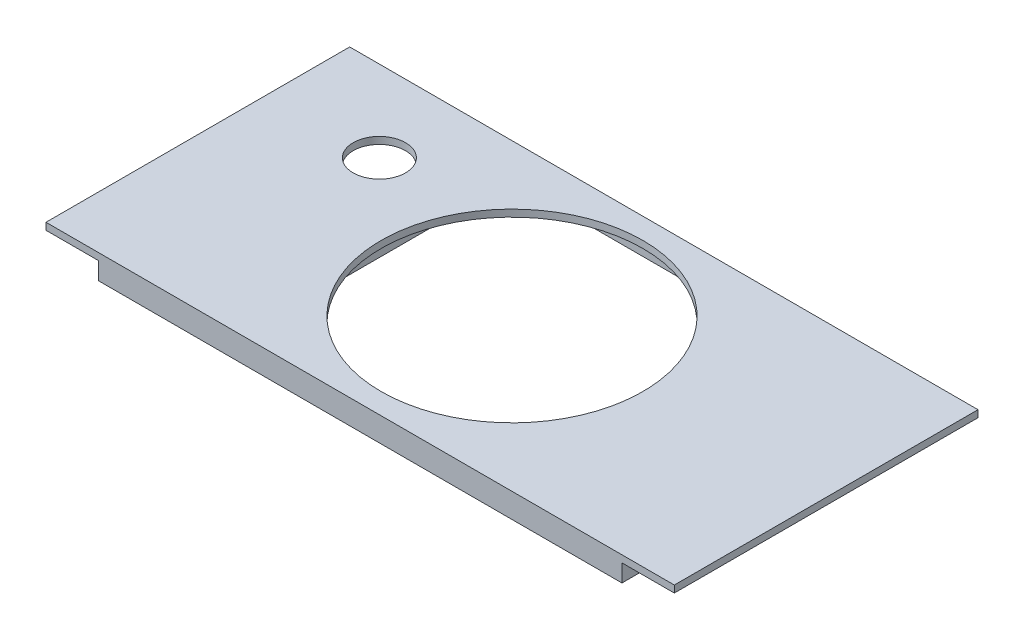
ISO-10303-21;
HEADER;
FILE_DESCRIPTION(('STEP AP214'),'2;1');
FILE_NAME('part.step','',(''),(''),'','','');
FILE_SCHEMA(('AUTOMOTIVE_DESIGN { 1 0 10303 214 1 1 1 1 }'));
ENDSEC;
DATA;
#1=APPLICATION_CONTEXT('core data for automotive mechanical design processes');
#2=APPLICATION_PROTOCOL_DEFINITION('international standard','automotive_design',2000,#1);
#3=PRODUCT_CONTEXT('',#1,'mechanical');
#4=PRODUCT('Part','Part','',(#3));
#5=PRODUCT_RELATED_PRODUCT_CATEGORY('part','',(#4));
#6=PRODUCT_DEFINITION_FORMATION('','',#4);
#7=PRODUCT_DEFINITION_CONTEXT('part definition',#1,'design');
#8=PRODUCT_DEFINITION('design','',#6,#7);
#9=PRODUCT_DEFINITION_SHAPE('','',#8);
#10=(LENGTH_UNIT() NAMED_UNIT(*) SI_UNIT(.MILLI.,.METRE.));
#11=(NAMED_UNIT(*) PLANE_ANGLE_UNIT() SI_UNIT($,.RADIAN.));
#12=(NAMED_UNIT(*) SI_UNIT($,.STERADIAN.) SOLID_ANGLE_UNIT());
#13=UNCERTAINTY_MEASURE_WITH_UNIT(LENGTH_MEASURE(1.E-05),#10,'distance_accuracy_value','');
#14=(GEOMETRIC_REPRESENTATION_CONTEXT(3) GLOBAL_UNCERTAINTY_ASSIGNED_CONTEXT((#13)) GLOBAL_UNIT_ASSIGNED_CONTEXT((#10,
#11,#12)) REPRESENTATION_CONTEXT('',''));
#15=CARTESIAN_POINT('',(0.,0.,0.));
#16=DIRECTION('',(0.,0.,1.));
#17=DIRECTION('',(1.,0.,0.));
#18=AXIS2_PLACEMENT_3D('',#15,#16,#17);
#19=CARTESIAN_POINT('',(0.,0.,0.));
#20=DIRECTION('',(0.,1.,0.));
#21=DIRECTION('',(0.,0.,1.));
#22=AXIS2_PLACEMENT_3D('',#19,#20,#21);
#23=PLANE('',#22);
#24=DIRECTION('',(1.,0.,0.));
#25=VECTOR('',#24,1.);
#26=CARTESIAN_POINT('',(-58.4029887206185,0.,40.7019366024999));
#27=LINE('',#26,#25);
#28=CARTESIAN_POINT('',(106.597011279381,0.,40.7019366024999));
#29=VERTEX_POINT('',#28);
#30=CARTESIAN_POINT('',(121.597011279381,0.,40.7019366024999));
#31=VERTEX_POINT('',#30);
#32=EDGE_CURVE('E286',#29,#31,#27,.T.);
#33=ORIENTED_EDGE('',*,*,#32,.F.);
#34=DIRECTION('',(0.,0.,-1.));
#35=VECTOR('',#34,1.);
#36=CARTESIAN_POINT('',(106.597011279381,0.,-46.2980633975001));
#37=LINE('',#36,#35);
#38=CARTESIAN_POINT('',(106.597011279381,0.,-46.2980633975001));
#39=VERTEX_POINT('',#38);
#40=EDGE_CURVE('E320',#29,#39,#37,.T.);
#41=ORIENTED_EDGE('',*,*,#40,.T.);
#42=DIRECTION('',(-1.,0.,0.));
#43=VECTOR('',#42,1.);
#44=CARTESIAN_POINT('',(-58.4029887206185,0.,-46.2980633975001));
#45=LINE('',#44,#43);
#46=CARTESIAN_POINT('',(121.597011279381,0.,-46.2980633975001));
#47=VERTEX_POINT('',#46);
#48=EDGE_CURVE('E277',#47,#39,#45,.T.);
#49=ORIENTED_EDGE('',*,*,#48,.F.);
#50=DIRECTION('',(0.,0.,-1.));
#51=VECTOR('',#50,1.);
#52=CARTESIAN_POINT('',(121.597011279381,0.,-46.2980633975001));
#53=LINE('',#52,#51);
#54=EDGE_CURVE('E289',#31,#47,#53,.T.);
#55=ORIENTED_EDGE('',*,*,#54,.F.);
#56=EDGE_LOOP('',(#33,#41,#49,#55));
#57=FACE_BOUND('',#56,.T.);
#58=ADVANCED_FACE('F33',(#57),#23,.F.);
#59=DIRECTION('',(0.,0.,-1.));
#60=VECTOR('',#59,1.);
#61=CARTESIAN_POINT('',(104.597011279381,0.,37.7019366024999));
#62=LINE('',#61,#60);
#63=CARTESIAN_POINT('',(104.597011279381,0.,37.7019366024999));
#64=VERTEX_POINT('',#63);
#65=CARTESIAN_POINT('',(104.597011279381,0.,-43.2980633975001));
#66=VERTEX_POINT('',#65);
#67=EDGE_CURVE('E184',#64,#66,#62,.T.);
#68=ORIENTED_EDGE('',*,*,#67,.F.);
#69=DIRECTION('',(1.,0.,0.));
#70=VECTOR('',#69,1.);
#71=CARTESIAN_POINT('',(106.597011279381,0.,37.7019366024999));
#72=LINE('',#71,#70);
#73=CARTESIAN_POINT('',(75.0970112793815,0.,37.7019366024999));
#74=VERTEX_POINT('',#73);
#75=EDGE_CURVE('E192',#74,#64,#72,.T.);
#76=ORIENTED_EDGE('',*,*,#75,.F.);
#77=DIRECTION('',(0.,0.,1.));
#78=VECTOR('',#77,1.);
#79=CARTESIAN_POINT('',(75.0970112793815,0.,-46.2980633975001));
#80=LINE('',#79,#78);
#81=CARTESIAN_POINT('',(75.0970112793815,0.,-43.2980633975001));
#82=VERTEX_POINT('',#81);
#83=EDGE_CURVE('E254',#82,#74,#80,.T.);
#84=ORIENTED_EDGE('',*,*,#83,.F.);
#85=DIRECTION('',(-1.,0.,0.));
#86=VECTOR('',#85,1.);
#87=CARTESIAN_POINT('',(106.597011279381,0.,-43.2980633975001));
#88=LINE('',#87,#86);
#89=EDGE_CURVE('E217',#66,#82,#88,.T.);
#90=ORIENTED_EDGE('',*,*,#89,.F.);
#91=EDGE_LOOP('',(#68,#76,#84,#90));
#92=FACE_BOUND('',#91,.T.);
#93=ADVANCED_FACE('F416',(#92),#23,.F.);
#94=CARTESIAN_POINT('',(106.597011279381,-5.,-43.2980633975001));
#95=DIRECTION('',(0.,0.,-1.));
#96=DIRECTION('',(-1.,0.,0.));
#97=AXIS2_PLACEMENT_3D('',#94,#95,#96);
#98=PLANE('',#97);
#99=DIRECTION('',(0.,1.,0.));
#100=VECTOR('',#99,1.);
#101=CARTESIAN_POINT('',(104.597011279381,-5.,-43.2980633975001));
#102=LINE('',#101,#100);
#103=CARTESIAN_POINT('',(104.597011279381,-5.,-43.2980633975001));
#104=VERTEX_POINT('',#103);
#105=EDGE_CURVE('E180',#104,#66,#102,.T.);
#106=ORIENTED_EDGE('',*,*,#105,.T.);
#107=ORIENTED_EDGE('',*,*,#89,.T.);
#108=DIRECTION('',(0.,-1.,0.));
#109=VECTOR('',#108,1.);
#110=CARTESIAN_POINT('',(75.0970112793815,-5.,-43.2980633975001));
#111=LINE('',#110,#109);
#112=CARTESIAN_POINT('',(75.0970112793815,-5.,-43.2980633975001));
#113=VERTEX_POINT('',#112);
#114=EDGE_CURVE('E221',#82,#113,#111,.T.);
#115=ORIENTED_EDGE('',*,*,#114,.T.);
#116=DIRECTION('',(-1.,0.,0.));
#117=VECTOR('',#116,1.);
#118=CARTESIAN_POINT('',(106.597011279381,-5.,-43.2980633975001));
#119=LINE('',#118,#117);
#120=EDGE_CURVE('E213',#104,#113,#119,.T.);
#121=ORIENTED_EDGE('',*,*,#120,.F.);
#122=EDGE_LOOP('',(#106,#107,#115,#121));
#123=FACE_BOUND('',#122,.T.);
#124=ADVANCED_FACE('F422',(#123),#98,.F.);
#125=CARTESIAN_POINT('',(106.597011279381,-5.,37.7019366024999));
#126=DIRECTION('',(0.,0.,1.));
#127=DIRECTION('',(1.,0.,0.));
#128=AXIS2_PLACEMENT_3D('',#125,#126,#127);
#129=PLANE('',#128);
#130=DIRECTION('',(0.,1.,0.));
#131=VECTOR('',#130,1.);
#132=CARTESIAN_POINT('',(104.597011279381,-5.,37.7019366024999));
#133=LINE('',#132,#131);
#134=CARTESIAN_POINT('',(104.597011279381,-5.,37.7019366024999));
#135=VERTEX_POINT('',#134);
#136=EDGE_CURVE('E177',#135,#64,#133,.T.);
#137=ORIENTED_EDGE('',*,*,#136,.F.);
#138=DIRECTION('',(1.,0.,0.));
#139=VECTOR('',#138,1.);
#140=CARTESIAN_POINT('',(106.597011279381,-5.,37.7019366024999));
#141=LINE('',#140,#139);
#142=CARTESIAN_POINT('',(75.0970112793815,-5.,37.7019366024999));
#143=VERTEX_POINT('',#142);
#144=EDGE_CURVE('E189',#143,#135,#141,.T.);
#145=ORIENTED_EDGE('',*,*,#144,.F.);
#146=DIRECTION('',(0.,1.,0.));
#147=VECTOR('',#146,1.);
#148=CARTESIAN_POINT('',(75.0970112793815,-5.,37.7019366024999));
#149=LINE('',#148,#147);
#150=EDGE_CURVE('E210',#143,#74,#149,.T.);
#151=ORIENTED_EDGE('',*,*,#150,.T.);
#152=ORIENTED_EDGE('',*,*,#75,.T.);
#153=EDGE_LOOP('',(#137,#145,#151,#152));
#154=FACE_BOUND('',#153,.T.);
#155=ADVANCED_FACE('F188',(#154),#129,.F.);
#156=DIRECTION('',(0.,0.,1.));
#157=VECTOR('',#156,1.);
#158=CARTESIAN_POINT('',(-43.4029887206185,0.,40.7019366024999));
#159=LINE('',#158,#157);
#160=CARTESIAN_POINT('',(-43.4029887206185,0.,-46.2980633975001));
#161=VERTEX_POINT('',#160);
#162=CARTESIAN_POINT('',(-43.4029887206185,0.,40.7019366024999));
#163=VERTEX_POINT('',#162);
#164=EDGE_CURVE('E342',#161,#163,#159,.T.);
#165=ORIENTED_EDGE('',*,*,#164,.T.);
#166=CARTESIAN_POINT('',(-58.4029887206185,0.,40.7019366024999));
#167=VERTEX_POINT('',#166);
#168=EDGE_CURVE('E294',#167,#163,#27,.T.);
#169=ORIENTED_EDGE('',*,*,#168,.F.);
#170=DIRECTION('',(0.,0.,1.));
#171=VECTOR('',#170,1.);
#172=CARTESIAN_POINT('',(-58.4029887206185,0.,-46.2980633975001));
#173=LINE('',#172,#171);
#174=CARTESIAN_POINT('',(-58.4029887206185,0.,-46.2980633975001));
#175=VERTEX_POINT('',#174);
#176=EDGE_CURVE('E272',#175,#167,#173,.T.);
#177=ORIENTED_EDGE('',*,*,#176,.F.);
#178=EDGE_CURVE('E297',#161,#175,#45,.T.);
#179=ORIENTED_EDGE('',*,*,#178,.F.);
#180=EDGE_LOOP('',(#165,#169,#177,#179));
#181=FACE_BOUND('',#180,.T.);
#182=ADVANCED_FACE('F340',(#181),#23,.F.);
#183=CARTESIAN_POINT('',(-26.6529887206185,0.,-23.0480633975001));
#184=DIRECTION('',(0.,-1.,0.));
#185=DIRECTION('',(0.,0.,-1.));
#186=AXIS2_PLACEMENT_3D('',#183,#184,#185);
#187=CIRCLE('',#186,7.5);
#188=CARTESIAN_POINT('',(-26.6529887206185,0.,-30.5480633975001));
#189=VERTEX_POINT('',#188);
#190=EDGE_CURVE('E374',#189,#189,#187,.T.);
#191=ORIENTED_EDGE('',*,*,#190,.F.);
#192=EDGE_LOOP('',(#191));
#193=FACE_BOUND('',#192,.T.);
#194=DIRECTION('',(0.,0.,1.));
#195=VECTOR('',#194,1.);
#196=CARTESIAN_POINT('',(-41.4029887206185,0.,-43.2980633975001));
#197=LINE('',#196,#195);
#198=CARTESIAN_POINT('',(-41.4029887206185,0.,-43.2980633975001));
#199=VERTEX_POINT('',#198);
#200=CARTESIAN_POINT('',(-41.4029887206185,0.,37.7019366024999));
#201=VERTEX_POINT('',#200);
#202=EDGE_CURVE('E50',#199,#201,#197,.T.);
#203=ORIENTED_EDGE('',*,*,#202,.F.);
#204=CARTESIAN_POINT('',(-11.9029887206186,0.,-43.2980633975001));
#205=VERTEX_POINT('',#204);
#206=EDGE_CURVE('E212',#205,#199,#88,.T.);
#207=ORIENTED_EDGE('',*,*,#206,.F.);
#208=DIRECTION('',(0.,0.,-1.));
#209=VECTOR('',#208,1.);
#210=CARTESIAN_POINT('',(-11.9029887206185,0.,-46.2980633975001));
#211=LINE('',#210,#209);
#212=CARTESIAN_POINT('',(-11.9029887206186,0.,37.7019366024999));
#213=VERTEX_POINT('',#212);
#214=EDGE_CURVE('E257',#213,#205,#211,.T.);
#215=ORIENTED_EDGE('',*,*,#214,.F.);
#216=EDGE_CURVE('E200',#201,#213,#72,.T.);
#217=ORIENTED_EDGE('',*,*,#216,.F.);
#218=EDGE_LOOP('',(#203,#207,#215,#217));
#219=FACE_BOUND('',#218,.T.);
#220=ADVANCED_FACE('F401',(#193,#219),#23,.F.);
#221=DIRECTION('',(0.,1.,0.));
#222=VECTOR('',#221,1.);
#223=CARTESIAN_POINT('',(-41.4029887206185,-5.,-43.2980633975001));
#224=LINE('',#223,#222);
#225=CARTESIAN_POINT('',(-41.4029887206185,-5.,-43.2980633975001));
#226=VERTEX_POINT('',#225);
#227=EDGE_CURVE('E57',#226,#199,#224,.T.);
#228=ORIENTED_EDGE('',*,*,#227,.F.);
#229=CARTESIAN_POINT('',(-11.9029887206186,-5.,-43.2980633975001));
#230=VERTEX_POINT('',#229);
#231=EDGE_CURVE('E216',#230,#226,#119,.T.);
#232=ORIENTED_EDGE('',*,*,#231,.F.);
#233=DIRECTION('',(0.,1.,0.));
#234=VECTOR('',#233,1.);
#235=CARTESIAN_POINT('',(-11.9029887206185,-5.,-43.2980633975001));
#236=LINE('',#235,#234);
#237=EDGE_CURVE('E215',#230,#205,#236,.T.);
#238=ORIENTED_EDGE('',*,*,#237,.T.);
#239=ORIENTED_EDGE('',*,*,#206,.T.);
#240=EDGE_LOOP('',(#228,#232,#238,#239));
#241=FACE_BOUND('',#240,.T.);
#242=ADVANCED_FACE('F414',(#241),#98,.F.);
#243=DIRECTION('',(0.,1.,0.));
#244=VECTOR('',#243,1.);
#245=CARTESIAN_POINT('',(-41.4029887206185,-5.,37.7019366024999));
#246=LINE('',#245,#244);
#247=CARTESIAN_POINT('',(-41.4029887206185,-5.,37.7019366024999));
#248=VERTEX_POINT('',#247);
#249=EDGE_CURVE('E363',#248,#201,#246,.T.);
#250=ORIENTED_EDGE('',*,*,#249,.T.);
#251=ORIENTED_EDGE('',*,*,#216,.T.);
#252=DIRECTION('',(0.,-1.,0.));
#253=VECTOR('',#252,1.);
#254=CARTESIAN_POINT('',(-11.9029887206185,-5.,37.7019366024999));
#255=LINE('',#254,#253);
#256=CARTESIAN_POINT('',(-11.9029887206186,-5.,37.7019366024999));
#257=VERTEX_POINT('',#256);
#258=EDGE_CURVE('E202',#213,#257,#255,.T.);
#259=ORIENTED_EDGE('',*,*,#258,.T.);
#260=EDGE_CURVE('E199',#248,#257,#141,.T.);
#261=ORIENTED_EDGE('',*,*,#260,.F.);
#262=EDGE_LOOP('',(#250,#251,#259,#261));
#263=FACE_BOUND('',#262,.T.);
#264=ADVANCED_FACE('F434',(#263),#129,.F.);
#265=CARTESIAN_POINT('',(75.0970112793815,-5.,-46.2980633975001));
#266=DIRECTION('',(-1.,0.,0.));
#267=DIRECTION('',(0.,0.,1.));
#268=AXIS2_PLACEMENT_3D('',#265,#266,#267);
#269=PLANE('',#268);
#270=ORIENTED_EDGE('',*,*,#150,.F.);
#271=DIRECTION('',(0.,0.,1.));
#272=VECTOR('',#271,1.);
#273=CARTESIAN_POINT('',(75.0970112793815,-5.,-46.2980633975001));
#274=LINE('',#273,#272);
#275=EDGE_CURVE('E198',#113,#143,#274,.T.);
#276=ORIENTED_EDGE('',*,*,#275,.F.);
#277=ORIENTED_EDGE('',*,*,#114,.F.);
#278=ORIENTED_EDGE('',*,*,#83,.T.);
#279=EDGE_LOOP('',(#270,#276,#277,#278));
#280=FACE_BOUND('',#279,.T.);
#281=ADVANCED_FACE('F408',(#280),#269,.F.);
#282=CARTESIAN_POINT('',(-11.9029887206185,-5.,-46.2980633975001));
#283=DIRECTION('',(1.,0.,0.));
#284=DIRECTION('',(0.,0.,-1.));
#285=AXIS2_PLACEMENT_3D('',#282,#283,#284);
#286=PLANE('',#285);
#287=ORIENTED_EDGE('',*,*,#258,.F.);
#288=ORIENTED_EDGE('',*,*,#214,.T.);
#289=ORIENTED_EDGE('',*,*,#237,.F.);
#290=DIRECTION('',(0.,0.,-1.));
#291=VECTOR('',#290,1.);
#292=CARTESIAN_POINT('',(-11.9029887206185,-5.,-46.2980633975001));
#293=LINE('',#292,#291);
#294=EDGE_CURVE('E256',#257,#230,#293,.T.);
#295=ORIENTED_EDGE('',*,*,#294,.F.);
#296=EDGE_LOOP('',(#287,#288,#289,#295));
#297=FACE_BOUND('',#296,.T.);
#298=ADVANCED_FACE('F398',(#297),#286,.F.);
#299=DIRECTION('',(1.,0.,0.));
#300=VECTOR('',#299,1.);
#301=CARTESIAN_POINT('',(-8.90298872061854,0.,-43.2980633975001));
#302=LINE('',#301,#300);
#303=CARTESIAN_POINT('',(-8.90298872061854,0.,-43.2980633975001));
#304=VERTEX_POINT('',#303);
#305=CARTESIAN_POINT('',(72.0970112793815,0.,-43.2980633975001));
#306=VERTEX_POINT('',#305);
#307=EDGE_CURVE('E228',#304,#306,#302,.T.);
#308=ORIENTED_EDGE('',*,*,#307,.T.);
#309=DIRECTION('',(0.,0.,1.));
#310=VECTOR('',#309,1.);
#311=CARTESIAN_POINT('',(72.0970112793815,0.,-43.2980633975001));
#312=LINE('',#311,#310);
#313=CARTESIAN_POINT('',(72.0970112793814,0.,37.7019366024999));
#314=VERTEX_POINT('',#313);
#315=EDGE_CURVE('E224',#306,#314,#312,.T.);
#316=ORIENTED_EDGE('',*,*,#315,.T.);
#317=DIRECTION('',(-1.,0.,0.));
#318=VECTOR('',#317,1.);
#319=CARTESIAN_POINT('',(-8.90298872061855,0.,37.7019366024999));
#320=LINE('',#319,#318);
#321=CARTESIAN_POINT('',(-8.90298872061855,0.,37.7019366024999));
#322=VERTEX_POINT('',#321);
#323=EDGE_CURVE('E238',#314,#322,#320,.T.);
#324=ORIENTED_EDGE('',*,*,#323,.T.);
#325=DIRECTION('',(0.,0.,-1.));
#326=VECTOR('',#325,1.);
#327=CARTESIAN_POINT('',(-8.90298872061854,0.,-43.2980633975001));
#328=LINE('',#327,#326);
#329=EDGE_CURVE('E241',#322,#304,#328,.T.);
#330=ORIENTED_EDGE('',*,*,#329,.T.);
#331=EDGE_LOOP('',(#308,#316,#324,#330));
#332=FACE_BOUND('',#331,.T.);
#333=CARTESIAN_POINT('',(31.5970112793815,0.,-2.79806339750011));
#334=DIRECTION('',(0.,-1.,0.));
#335=DIRECTION('',(0.,0.,-1.));
#336=AXIS2_PLACEMENT_3D('',#333,#334,#335);
#337=CIRCLE('',#336,37.5);
#338=CARTESIAN_POINT('',(31.5970112793815,0.,-40.2980633975001));
#339=VERTEX_POINT('',#338);
#340=EDGE_CURVE('E259',#339,#339,#337,.T.);
#341=ORIENTED_EDGE('',*,*,#340,.F.);
#342=EDGE_LOOP('',(#341));
#343=FACE_BOUND('',#342,.T.);
#344=ADVANCED_FACE('F396',(#332,#343),#23,.F.);
#345=CARTESIAN_POINT('',(-58.4029887206185,2.,-46.2980633975001));
#346=DIRECTION('',(1.,0.,0.));
#347=DIRECTION('',(0.,0.,-1.));
#348=AXIS2_PLACEMENT_3D('',#345,#346,#347);
#349=PLANE('',#348);
#350=ORIENTED_EDGE('',*,*,#176,.T.);
#351=DIRECTION('',(0.,-1.,0.));
#352=VECTOR('',#351,1.);
#353=CARTESIAN_POINT('',(-58.4029887206185,2.,40.7019366024999));
#354=LINE('',#353,#352);
#355=CARTESIAN_POINT('',(-58.4029887206185,2.,40.7019366024999));
#356=VERTEX_POINT('',#355);
#357=EDGE_CURVE('E11',#356,#167,#354,.T.);
#358=ORIENTED_EDGE('',*,*,#357,.F.);
#359=DIRECTION('',(0.,0.,1.));
#360=VECTOR('',#359,1.);
#361=CARTESIAN_POINT('',(-58.4029887206185,2.,-46.2980633975001));
#362=LINE('',#361,#360);
#363=CARTESIAN_POINT('',(-58.4029887206185,2.,-46.2980633975001));
#364=VERTEX_POINT('',#363);
#365=EDGE_CURVE('E273',#364,#356,#362,.T.);
#366=ORIENTED_EDGE('',*,*,#365,.F.);
#367=DIRECTION('',(0.,-1.,0.));
#368=VECTOR('',#367,1.);
#369=CARTESIAN_POINT('',(-58.4029887206185,2.,-46.2980633975001));
#370=LINE('',#369,#368);
#371=EDGE_CURVE('E283',#364,#175,#370,.T.);
#372=ORIENTED_EDGE('',*,*,#371,.T.);
#373=EDGE_LOOP('',(#350,#358,#366,#372));
#374=FACE_BOUND('',#373,.T.);
#375=ADVANCED_FACE('F35',(#374),#349,.F.);
#376=CARTESIAN_POINT('',(-58.4029887206185,2.,40.7019366024999));
#377=DIRECTION('',(0.,0.,-1.));
#378=DIRECTION('',(-1.,0.,0.));
#379=AXIS2_PLACEMENT_3D('',#376,#377,#378);
#380=PLANE('',#379);
#381=ORIENTED_EDGE('',*,*,#168,.T.);
#382=DIRECTION('',(0.,-1.,0.));
#383=VECTOR('',#382,1.);
#384=CARTESIAN_POINT('',(-43.4029887206185,87.0229854693574,40.7019366024999));
#385=LINE('',#384,#383);
#386=CARTESIAN_POINT('',(-43.4029887206185,-5.,40.7019366024999));
#387=VERTEX_POINT('',#386);
#388=EDGE_CURVE('E344',#163,#387,#385,.T.);
#389=ORIENTED_EDGE('',*,*,#388,.T.);
#390=DIRECTION('',(-1.,0.,0.));
#391=VECTOR('',#390,1.);
#392=CARTESIAN_POINT('',(-45.4029887206185,-5.,40.7019366024999));
#393=LINE('',#392,#391);
#394=CARTESIAN_POINT('',(106.597011279381,-5.,40.7019366024999));
#395=VERTEX_POINT('',#394);
#396=EDGE_CURVE('E269',#395,#387,#393,.T.);
#397=ORIENTED_EDGE('',*,*,#396,.F.);
#398=DIRECTION('',(0.,-1.,0.));
#399=VECTOR('',#398,1.);
#400=CARTESIAN_POINT('',(106.597011279381,87.0229854693574,40.7019366024999));
#401=LINE('',#400,#399);
#402=EDGE_CURVE('E205',#29,#395,#401,.T.);
#403=ORIENTED_EDGE('',*,*,#402,.F.);
#404=ORIENTED_EDGE('',*,*,#32,.T.);
#405=DIRECTION('',(0.,-1.,0.));
#406=VECTOR('',#405,1.);
#407=CARTESIAN_POINT('',(121.597011279381,2.,40.7019366024999));
#408=LINE('',#407,#406);
#409=CARTESIAN_POINT('',(121.597011279381,2.,40.7019366024999));
#410=VERTEX_POINT('',#409);
#411=EDGE_CURVE('E42',#410,#31,#408,.T.);
#412=ORIENTED_EDGE('',*,*,#411,.F.);
#413=DIRECTION('',(1.,0.,0.));
#414=VECTOR('',#413,1.);
#415=CARTESIAN_POINT('',(-58.4029887206185,2.,40.7019366024999));
#416=LINE('',#415,#414);
#417=EDGE_CURVE('E276',#356,#410,#416,.T.);
#418=ORIENTED_EDGE('',*,*,#417,.F.);
#419=ORIENTED_EDGE('',*,*,#357,.T.);
#420=EDGE_LOOP('',(#381,#389,#397,#403,#404,#412,#418,#419));
#421=FACE_BOUND('',#420,.T.);
#422=ADVANCED_FACE('F334',(#421),#380,.F.);
#423=CARTESIAN_POINT('',(121.597011279381,2.,-46.2980633975001));
#424=DIRECTION('',(-1.,0.,0.));
#425=DIRECTION('',(0.,0.,1.));
#426=AXIS2_PLACEMENT_3D('',#423,#424,#425);
#427=PLANE('',#426);
#428=ORIENTED_EDGE('',*,*,#54,.T.);
#429=DIRECTION('',(0.,-1.,0.));
#430=VECTOR('',#429,1.);
#431=CARTESIAN_POINT('',(121.597011279381,2.,-46.2980633975001));
#432=LINE('',#431,#430);
#433=CARTESIAN_POINT('',(121.597011279381,2.,-46.2980633975001));
#434=VERTEX_POINT('',#433);
#435=EDGE_CURVE('E304',#434,#47,#432,.T.);
#436=ORIENTED_EDGE('',*,*,#435,.F.);
#437=DIRECTION('',(0.,0.,-1.));
#438=VECTOR('',#437,1.);
#439=CARTESIAN_POINT('',(121.597011279381,2.,-46.2980633975001));
#440=LINE('',#439,#438);
#441=EDGE_CURVE('E279',#410,#434,#440,.T.);
#442=ORIENTED_EDGE('',*,*,#441,.F.);
#443=ORIENTED_EDGE('',*,*,#411,.T.);
#444=EDGE_LOOP('',(#428,#436,#442,#443));
#445=FACE_BOUND('',#444,.T.);
#446=ADVANCED_FACE('F312',(#445),#427,.F.);
#447=CARTESIAN_POINT('',(-58.4029887206185,2.,-46.2980633975001));
#448=DIRECTION('',(0.,0.,1.));
#449=DIRECTION('',(1.,0.,0.));
#450=AXIS2_PLACEMENT_3D('',#447,#448,#449);
#451=PLANE('',#450);
#452=DIRECTION('',(0.,-1.,0.));
#453=VECTOR('',#452,1.);
#454=CARTESIAN_POINT('',(-43.4029887206185,87.0229854693574,-46.2980633975001));
#455=LINE('',#454,#453);
#456=CARTESIAN_POINT('',(-43.4029887206185,-5.,-46.2980633975001));
#457=VERTEX_POINT('',#456);
#458=EDGE_CURVE('E345',#161,#457,#455,.T.);
#459=ORIENTED_EDGE('',*,*,#458,.F.);
#460=ORIENTED_EDGE('',*,*,#178,.T.);
#461=ORIENTED_EDGE('',*,*,#371,.F.);
#462=DIRECTION('',(-1.,0.,0.));
#463=VECTOR('',#462,1.);
#464=CARTESIAN_POINT('',(-58.4029887206185,2.,-46.2980633975001));
#465=LINE('',#464,#463);
#466=EDGE_CURVE('E281',#434,#364,#465,.T.);
#467=ORIENTED_EDGE('',*,*,#466,.F.);
#468=ORIENTED_EDGE('',*,*,#435,.T.);
#469=ORIENTED_EDGE('',*,*,#48,.T.);
#470=DIRECTION('',(0.,-1.,0.));
#471=VECTOR('',#470,1.);
#472=CARTESIAN_POINT('',(106.597011279381,87.0229854693574,-46.2980633975001));
#473=LINE('',#472,#471);
#474=CARTESIAN_POINT('',(106.597011279381,-5.,-46.2980633975001));
#475=VERTEX_POINT('',#474);
#476=EDGE_CURVE('E327',#39,#475,#473,.T.);
#477=ORIENTED_EDGE('',*,*,#476,.T.);
#478=DIRECTION('',(1.,0.,0.));
#479=VECTOR('',#478,1.);
#480=CARTESIAN_POINT('',(-45.4029887206185,-5.,-46.2980633975001));
#481=LINE('',#480,#479);
#482=EDGE_CURVE('E266',#457,#475,#481,.T.);
#483=ORIENTED_EDGE('',*,*,#482,.F.);
#484=EDGE_LOOP('',(#459,#460,#461,#467,#468,#469,#477,#483));
#485=FACE_BOUND('',#484,.T.);
#486=ADVANCED_FACE('F325',(#485),#451,.F.);
#487=CARTESIAN_POINT('',(0.,2.,0.));
#488=DIRECTION('',(0.,1.,0.));
#489=DIRECTION('',(0.,0.,1.));
#490=AXIS2_PLACEMENT_3D('',#487,#488,#489);
#491=PLANE('',#490);
#492=CARTESIAN_POINT('',(-26.6529887206185,2.,-23.0480633975001));
#493=DIRECTION('',(0.,1.,0.));
#494=DIRECTION('',(0.,0.,1.));
#495=AXIS2_PLACEMENT_3D('',#492,#493,#494);
#496=CIRCLE('',#495,7.5);
#497=CARTESIAN_POINT('',(-26.6529887206185,2.,-15.5480633975001));
#498=VERTEX_POINT('',#497);
#499=EDGE_CURVE('E37',#498,#498,#496,.T.);
#500=ORIENTED_EDGE('',*,*,#499,.F.);
#501=EDGE_LOOP('',(#500));
#502=FACE_BOUND('',#501,.T.);
#503=CARTESIAN_POINT('',(31.5970112793815,2.,-2.79806339750011));
#504=DIRECTION('',(0.,1.,0.));
#505=DIRECTION('',(0.,0.,1.));
#506=AXIS2_PLACEMENT_3D('',#503,#504,#505);
#507=CIRCLE('',#506,37.5);
#508=CARTESIAN_POINT('',(31.5970112793815,2.,34.7019366024999));
#509=VERTEX_POINT('',#508);
#510=EDGE_CURVE('E265',#509,#509,#507,.T.);
#511=ORIENTED_EDGE('',*,*,#510,.F.);
#512=EDGE_LOOP('',(#511));
#513=FACE_BOUND('',#512,.T.);
#514=ORIENTED_EDGE('',*,*,#365,.T.);
#515=ORIENTED_EDGE('',*,*,#417,.T.);
#516=ORIENTED_EDGE('',*,*,#441,.T.);
#517=ORIENTED_EDGE('',*,*,#466,.T.);
#518=EDGE_LOOP('',(#514,#515,#516,#517));
#519=FACE_BOUND('',#518,.T.);
#520=ADVANCED_FACE('F332',(#502,#513,#519),#491,.T.);
#521=CARTESIAN_POINT('',(0.,-5.,0.));
#522=DIRECTION('',(0.,-1.,0.));
#523=DIRECTION('',(0.,0.,-1.));
#524=AXIS2_PLACEMENT_3D('',#521,#522,#523);
#525=PLANE('',#524);
#526=DIRECTION('',(0.,0.,-1.));
#527=VECTOR('',#526,1.);
#528=CARTESIAN_POINT('',(104.597011279381,-5.,37.7019366024999));
#529=LINE('',#528,#527);
#530=EDGE_CURVE('E174',#135,#104,#529,.T.);
#531=ORIENTED_EDGE('',*,*,#530,.T.);
#532=ORIENTED_EDGE('',*,*,#120,.T.);
#533=ORIENTED_EDGE('',*,*,#275,.T.);
#534=ORIENTED_EDGE('',*,*,#144,.T.);
#535=EDGE_LOOP('',(#531,#532,#533,#534));
#536=FACE_BOUND('',#535,.T.);
#537=ORIENTED_EDGE('',*,*,#231,.T.);
#538=DIRECTION('',(0.,0.,1.));
#539=VECTOR('',#538,1.);
#540=CARTESIAN_POINT('',(-41.4029887206185,-5.,-43.2980633975001));
#541=LINE('',#540,#539);
#542=EDGE_CURVE('E366',#226,#248,#541,.T.);
#543=ORIENTED_EDGE('',*,*,#542,.T.);
#544=ORIENTED_EDGE('',*,*,#260,.T.);
#545=ORIENTED_EDGE('',*,*,#294,.T.);
#546=EDGE_LOOP('',(#537,#543,#544,#545));
#547=FACE_BOUND('',#546,.T.);
#548=DIRECTION('',(0.,0.,1.));
#549=VECTOR('',#548,1.);
#550=CARTESIAN_POINT('',(-43.4029887206185,-5.,40.7019366024999));
#551=LINE('',#550,#549);
#552=EDGE_CURVE('E349',#457,#387,#551,.T.);
#553=ORIENTED_EDGE('',*,*,#552,.F.);
#554=ORIENTED_EDGE('',*,*,#482,.T.);
#555=DIRECTION('',(0.,0.,-1.));
#556=VECTOR('',#555,1.);
#557=CARTESIAN_POINT('',(106.597011279381,-5.,-46.2980633975001));
#558=LINE('',#557,#556);
#559=EDGE_CURVE('E347',#395,#475,#558,.T.);
#560=ORIENTED_EDGE('',*,*,#559,.F.);
#561=ORIENTED_EDGE('',*,*,#396,.T.);
#562=EDGE_LOOP('',(#553,#554,#560,#561));
#563=FACE_BOUND('',#562,.T.);
#564=DIRECTION('',(-1.,0.,0.));
#565=VECTOR('',#564,1.);
#566=CARTESIAN_POINT('',(-8.90298872061855,-5.,37.7019366024999));
#567=LINE('',#566,#565);
#568=CARTESIAN_POINT('',(72.0970112793814,-5.,37.7019366024999));
#569=VERTEX_POINT('',#568);
#570=CARTESIAN_POINT('',(-8.90298872061855,-5.,37.7019366024999));
#571=VERTEX_POINT('',#570);
#572=EDGE_CURVE('E227',#569,#571,#567,.T.);
#573=ORIENTED_EDGE('',*,*,#572,.F.);
#574=DIRECTION('',(0.,0.,1.));
#575=VECTOR('',#574,1.);
#576=CARTESIAN_POINT('',(72.0970112793815,-5.,-43.2980633975001));
#577=LINE('',#576,#575);
#578=CARTESIAN_POINT('',(72.0970112793815,-5.,-43.2980633975001));
#579=VERTEX_POINT('',#578);
#580=EDGE_CURVE('E225',#579,#569,#577,.T.);
#581=ORIENTED_EDGE('',*,*,#580,.F.);
#582=DIRECTION('',(1.,0.,0.));
#583=VECTOR('',#582,1.);
#584=CARTESIAN_POINT('',(-8.90298872061854,-5.,-43.2980633975001));
#585=LINE('',#584,#583);
#586=CARTESIAN_POINT('',(-8.90298872061854,-5.,-43.2980633975001));
#587=VERTEX_POINT('',#586);
#588=EDGE_CURVE('E233',#587,#579,#585,.T.);
#589=ORIENTED_EDGE('',*,*,#588,.F.);
#590=DIRECTION('',(0.,0.,-1.));
#591=VECTOR('',#590,1.);
#592=CARTESIAN_POINT('',(-8.90298872061854,-5.,-43.2980633975001));
#593=LINE('',#592,#591);
#594=EDGE_CURVE('E230',#571,#587,#593,.T.);
#595=ORIENTED_EDGE('',*,*,#594,.F.);
#596=EDGE_LOOP('',(#573,#581,#589,#595));
#597=FACE_BOUND('',#596,.T.);
#598=ADVANCED_FACE('F195',(#536,#547,#563,#597),#525,.T.);
#599=CARTESIAN_POINT('',(31.5970112793815,5.,-2.79806339750011));
#600=DIRECTION('',(0.,-1.,0.));
#601=DIRECTION('',(0.,0.,-1.));
#602=AXIS2_PLACEMENT_3D('',#599,#600,#601);
#603=CYLINDRICAL_SURFACE('',#602,37.5);
#604=ORIENTED_EDGE('',*,*,#510,.T.);
#605=EDGE_LOOP('',(#604));
#606=FACE_BOUND('',#605,.T.);
#607=ORIENTED_EDGE('',*,*,#340,.T.);
#608=EDGE_LOOP('',(#607));
#609=FACE_BOUND('',#608,.T.);
#610=ADVANCED_FACE('F389',(#606,#609),#603,.F.);
#611=CARTESIAN_POINT('',(72.0970112793815,-5.,-43.2980633975001));
#612=DIRECTION('',(-1.,0.,0.));
#613=DIRECTION('',(0.,0.,1.));
#614=AXIS2_PLACEMENT_3D('',#611,#612,#613);
#615=PLANE('',#614);
#616=ORIENTED_EDGE('',*,*,#315,.F.);
#617=DIRECTION('',(0.,1.,0.));
#618=VECTOR('',#617,1.);
#619=CARTESIAN_POINT('',(72.0970112793815,-5.,-43.2980633975001));
#620=LINE('',#619,#618);
#621=EDGE_CURVE('E235',#579,#306,#620,.T.);
#622=ORIENTED_EDGE('',*,*,#621,.F.);
#623=ORIENTED_EDGE('',*,*,#580,.T.);
#624=DIRECTION('',(0.,1.,0.));
#625=VECTOR('',#624,1.);
#626=CARTESIAN_POINT('',(72.0970112793814,-5.,37.7019366024999));
#627=LINE('',#626,#625);
#628=EDGE_CURVE('E251',#569,#314,#627,.T.);
#629=ORIENTED_EDGE('',*,*,#628,.T.);
#630=EDGE_LOOP('',(#616,#622,#623,#629));
#631=FACE_BOUND('',#630,.T.);
#632=ADVANCED_FACE('F392',(#631),#615,.T.);
#633=CARTESIAN_POINT('',(-8.90298872061855,-5.,37.7019366024999));
#634=DIRECTION('',(0.,0.,-1.));
#635=DIRECTION('',(-1.,0.,0.));
#636=AXIS2_PLACEMENT_3D('',#633,#634,#635);
#637=PLANE('',#636);
#638=ORIENTED_EDGE('',*,*,#323,.F.);
#639=ORIENTED_EDGE('',*,*,#628,.F.);
#640=ORIENTED_EDGE('',*,*,#572,.T.);
#641=DIRECTION('',(0.,1.,0.));
#642=VECTOR('',#641,1.);
#643=CARTESIAN_POINT('',(-8.90298872061855,-5.,37.7019366024999));
#644=LINE('',#643,#642);
#645=EDGE_CURVE('E249',#571,#322,#644,.T.);
#646=ORIENTED_EDGE('',*,*,#645,.T.);
#647=EDGE_LOOP('',(#638,#639,#640,#646));
#648=FACE_BOUND('',#647,.T.);
#649=ADVANCED_FACE('F615',(#648),#637,.T.);
#650=CARTESIAN_POINT('',(-8.90298872061854,-5.,-43.2980633975001));
#651=DIRECTION('',(1.,0.,0.));
#652=DIRECTION('',(0.,0.,-1.));
#653=AXIS2_PLACEMENT_3D('',#650,#651,#652);
#654=PLANE('',#653);
#655=ORIENTED_EDGE('',*,*,#329,.F.);
#656=ORIENTED_EDGE('',*,*,#645,.F.);
#657=ORIENTED_EDGE('',*,*,#594,.T.);
#658=DIRECTION('',(0.,1.,0.));
#659=VECTOR('',#658,1.);
#660=CARTESIAN_POINT('',(-8.90298872061854,-5.,-43.2980633975001));
#661=LINE('',#660,#659);
#662=EDGE_CURVE('E247',#587,#304,#661,.T.);
#663=ORIENTED_EDGE('',*,*,#662,.T.);
#664=EDGE_LOOP('',(#655,#656,#657,#663));
#665=FACE_BOUND('',#664,.T.);
#666=ADVANCED_FACE('F604',(#665),#654,.T.);
#667=CARTESIAN_POINT('',(-8.90298872061854,-5.,-43.2980633975001));
#668=DIRECTION('',(0.,0.,1.));
#669=DIRECTION('',(1.,0.,0.));
#670=AXIS2_PLACEMENT_3D('',#667,#668,#669);
#671=PLANE('',#670);
#672=ORIENTED_EDGE('',*,*,#307,.F.);
#673=ORIENTED_EDGE('',*,*,#662,.F.);
#674=ORIENTED_EDGE('',*,*,#588,.T.);
#675=ORIENTED_EDGE('',*,*,#621,.T.);
#676=EDGE_LOOP('',(#672,#673,#674,#675));
#677=FACE_BOUND('',#676,.T.);
#678=ADVANCED_FACE('F455',(#677),#671,.T.);
#679=CARTESIAN_POINT('',(106.597011279381,87.0229854693574,-46.2980633975001));
#680=DIRECTION('',(-1.,0.,0.));
#681=DIRECTION('',(0.,0.,1.));
#682=AXIS2_PLACEMENT_3D('',#679,#680,#681);
#683=PLANE('',#682);
#684=ORIENTED_EDGE('',*,*,#559,.T.);
#685=ORIENTED_EDGE('',*,*,#476,.F.);
#686=ORIENTED_EDGE('',*,*,#40,.F.);
#687=ORIENTED_EDGE('',*,*,#402,.T.);
#688=EDGE_LOOP('',(#684,#685,#686,#687));
#689=FACE_BOUND('',#688,.T.);
#690=ADVANCED_FACE('F357',(#689),#683,.F.);
#691=CARTESIAN_POINT('',(-43.4029887206185,87.0229854693574,40.7019366024999));
#692=DIRECTION('',(1.,0.,0.));
#693=DIRECTION('',(0.,0.,-1.));
#694=AXIS2_PLACEMENT_3D('',#691,#692,#693);
#695=PLANE('',#694);
#696=ORIENTED_EDGE('',*,*,#164,.F.);
#697=ORIENTED_EDGE('',*,*,#458,.T.);
#698=ORIENTED_EDGE('',*,*,#552,.T.);
#699=ORIENTED_EDGE('',*,*,#388,.F.);
#700=EDGE_LOOP('',(#696,#697,#698,#699));
#701=FACE_BOUND('',#700,.T.);
#702=ADVANCED_FACE('F362',(#701),#695,.F.);
#703=CARTESIAN_POINT('',(-41.4029887206185,-5.,-43.2980633975001));
#704=DIRECTION('',(-1.,0.,0.));
#705=DIRECTION('',(0.,0.,1.));
#706=AXIS2_PLACEMENT_3D('',#703,#704,#705);
#707=PLANE('',#706);
#708=ORIENTED_EDGE('',*,*,#202,.T.);
#709=ORIENTED_EDGE('',*,*,#249,.F.);
#710=ORIENTED_EDGE('',*,*,#542,.F.);
#711=ORIENTED_EDGE('',*,*,#227,.T.);
#712=EDGE_LOOP('',(#708,#709,#710,#711));
#713=FACE_BOUND('',#712,.T.);
#714=ADVANCED_FACE('F462',(#713),#707,.F.);
#715=CARTESIAN_POINT('',(104.597011279381,-5.,37.7019366024999));
#716=DIRECTION('',(1.,0.,0.));
#717=DIRECTION('',(0.,0.,-1.));
#718=AXIS2_PLACEMENT_3D('',#715,#716,#717);
#719=PLANE('',#718);
#720=ORIENTED_EDGE('',*,*,#67,.T.);
#721=ORIENTED_EDGE('',*,*,#105,.F.);
#722=ORIENTED_EDGE('',*,*,#530,.F.);
#723=ORIENTED_EDGE('',*,*,#136,.T.);
#724=EDGE_LOOP('',(#720,#721,#722,#723));
#725=FACE_BOUND('',#724,.T.);
#726=ADVANCED_FACE('F176',(#725),#719,.F.);
#727=CARTESIAN_POINT('',(-26.6529887206185,5.,-23.0480633975001));
#728=DIRECTION('',(0.,-1.,0.));
#729=DIRECTION('',(0.,0.,-1.));
#730=AXIS2_PLACEMENT_3D('',#727,#728,#729);
#731=CYLINDRICAL_SURFACE('',#730,7.5);
#732=ORIENTED_EDGE('',*,*,#499,.T.);
#733=EDGE_LOOP('',(#732));
#734=FACE_BOUND('',#733,.T.);
#735=ORIENTED_EDGE('',*,*,#190,.T.);
#736=EDGE_LOOP('',(#735));
#737=FACE_BOUND('',#736,.T.);
#738=ADVANCED_FACE('F381',(#734,#737),#731,.F.);
#739=CLOSED_SHELL('',(#58,#93,#124,#155,#182,#220,#242,#264,#281,#298,#344,#375,#422,#446,#486,
#520,#598,#610,#632,#649,#666,#678,#690,#702,#714,#726,#738));
#740=MANIFOLD_SOLID_BREP('B2',#739);
#741=ADVANCED_BREP_SHAPE_REPRESENTATION('',(#18,#740),#14);
#742=SHAPE_DEFINITION_REPRESENTATION(#9,#741);
ENDSEC;
END-ISO-10303-21;
